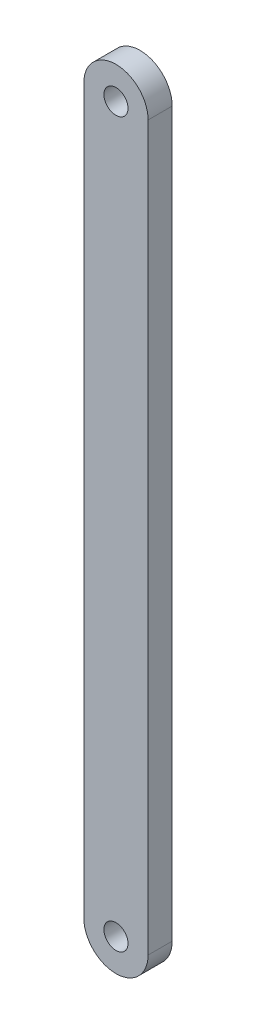
ISO-10303-21;
HEADER;
FILE_DESCRIPTION(('STEP AP214'),'2;1');
FILE_NAME('part.step','',(''),(''),'','','');
FILE_SCHEMA(('AUTOMOTIVE_DESIGN { 1 0 10303 214 1 1 1 1 }'));
ENDSEC;
DATA;
#1=APPLICATION_CONTEXT('core data for automotive mechanical design processes');
#2=APPLICATION_PROTOCOL_DEFINITION('international standard','automotive_design',2000,#1);
#3=PRODUCT_CONTEXT('',#1,'mechanical');
#4=PRODUCT('Part','Part','',(#3));
#5=PRODUCT_RELATED_PRODUCT_CATEGORY('part','',(#4));
#6=PRODUCT_DEFINITION_FORMATION('','',#4);
#7=PRODUCT_DEFINITION_CONTEXT('part definition',#1,'design');
#8=PRODUCT_DEFINITION('design','',#6,#7);
#9=PRODUCT_DEFINITION_SHAPE('','',#8);
#10=(LENGTH_UNIT() NAMED_UNIT(*) SI_UNIT(.MILLI.,.METRE.));
#11=(NAMED_UNIT(*) PLANE_ANGLE_UNIT() SI_UNIT($,.RADIAN.));
#12=(NAMED_UNIT(*) SI_UNIT($,.STERADIAN.) SOLID_ANGLE_UNIT());
#13=UNCERTAINTY_MEASURE_WITH_UNIT(LENGTH_MEASURE(1.E-05),#10,'distance_accuracy_value','');
#14=(GEOMETRIC_REPRESENTATION_CONTEXT(3) GLOBAL_UNCERTAINTY_ASSIGNED_CONTEXT((#13)) GLOBAL_UNIT_ASSIGNED_CONTEXT((#10,
#11,#12)) REPRESENTATION_CONTEXT('',''));
#15=CARTESIAN_POINT('',(0.,0.,0.));
#16=DIRECTION('',(0.,0.,1.));
#17=DIRECTION('',(1.,0.,0.));
#18=AXIS2_PLACEMENT_3D('',#15,#16,#17);
#19=CARTESIAN_POINT('',(3.99999999999999,45.,3.));
#20=DIRECTION('',(-1.,0.,0.));
#21=DIRECTION('',(0.,-1.,0.));
#22=AXIS2_PLACEMENT_3D('',#19,#20,#21);
#23=PLANE('',#22);
#24=DIRECTION('',(0.,1.,0.));
#25=VECTOR('',#24,1.);
#26=CARTESIAN_POINT('',(3.99999999999999,45.,0.));
#27=LINE('',#26,#25);
#28=CARTESIAN_POINT('',(4.,-45.,0.));
#29=VERTEX_POINT('',#28);
#30=CARTESIAN_POINT('',(4.,45.,0.));
#31=VERTEX_POINT('',#30);
#32=EDGE_CURVE('E76',#29,#31,#27,.T.);
#33=ORIENTED_EDGE('',*,*,#32,.T.);
#34=DIRECTION('',(0.,0.,-1.));
#35=VECTOR('',#34,1.);
#36=CARTESIAN_POINT('',(3.99999999999999,45.,3.));
#37=LINE('',#36,#35);
#38=CARTESIAN_POINT('',(4.,45.,3.));
#39=VERTEX_POINT('',#38);
#40=EDGE_CURVE('E11',#39,#31,#37,.T.);
#41=ORIENTED_EDGE('',*,*,#40,.F.);
#42=DIRECTION('',(0.,1.,0.));
#43=VECTOR('',#42,1.);
#44=CARTESIAN_POINT('',(3.99999999999999,45.,3.));
#45=LINE('',#44,#43);
#46=CARTESIAN_POINT('',(4.00000000000001,-45.,3.));
#47=VERTEX_POINT('',#46);
#48=EDGE_CURVE('E51',#47,#39,#45,.T.);
#49=ORIENTED_EDGE('',*,*,#48,.F.);
#50=DIRECTION('',(0.,0.,-1.));
#51=VECTOR('',#50,1.);
#52=CARTESIAN_POINT('',(4.00000000000001,-45.,3.));
#53=LINE('',#52,#51);
#54=EDGE_CURVE('E84',#47,#29,#53,.T.);
#55=ORIENTED_EDGE('',*,*,#54,.T.);
#56=EDGE_LOOP('',(#33,#41,#49,#55));
#57=FACE_BOUND('',#56,.T.);
#58=ADVANCED_FACE('F35',(#57),#23,.F.);
#59=CARTESIAN_POINT('',(-4.,45.,3.));
#60=DIRECTION('',(1.,0.,0.));
#61=DIRECTION('',(0.,1.,0.));
#62=AXIS2_PLACEMENT_3D('',#59,#60,#61);
#63=PLANE('',#62);
#64=DIRECTION('',(0.,-1.,0.));
#65=VECTOR('',#64,1.);
#66=CARTESIAN_POINT('',(-4.,45.,0.));
#67=LINE('',#66,#65);
#68=CARTESIAN_POINT('',(-4.,45.,0.));
#69=VERTEX_POINT('',#68);
#70=CARTESIAN_POINT('',(-3.99999999999999,-45.,0.));
#71=VERTEX_POINT('',#70);
#72=EDGE_CURVE('E81',#69,#71,#67,.T.);
#73=ORIENTED_EDGE('',*,*,#72,.T.);
#74=DIRECTION('',(0.,0.,-1.));
#75=VECTOR('',#74,1.);
#76=CARTESIAN_POINT('',(-3.99999999999999,-45.,3.));
#77=LINE('',#76,#75);
#78=CARTESIAN_POINT('',(-3.99999999999999,-45.,3.));
#79=VERTEX_POINT('',#78);
#80=EDGE_CURVE('E88',#79,#71,#77,.T.);
#81=ORIENTED_EDGE('',*,*,#80,.F.);
#82=DIRECTION('',(0.,-1.,0.));
#83=VECTOR('',#82,1.);
#84=CARTESIAN_POINT('',(-4.,45.,3.));
#85=LINE('',#84,#83);
#86=CARTESIAN_POINT('',(-4.,45.,3.));
#87=VERTEX_POINT('',#86);
#88=EDGE_CURVE('E89',#87,#79,#85,.T.);
#89=ORIENTED_EDGE('',*,*,#88,.F.);
#90=DIRECTION('',(0.,0.,-1.));
#91=VECTOR('',#90,1.);
#92=CARTESIAN_POINT('',(-4.,45.,3.));
#93=LINE('',#92,#91);
#94=EDGE_CURVE('E43',#87,#69,#93,.T.);
#95=ORIENTED_EDGE('',*,*,#94,.T.);
#96=EDGE_LOOP('',(#73,#81,#89,#95));
#97=FACE_BOUND('',#96,.T.);
#98=ADVANCED_FACE('F111',(#97),#63,.F.);
#99=CARTESIAN_POINT('',(0.,0.,3.));
#100=DIRECTION('',(0.,0.,1.));
#101=DIRECTION('',(1.,0.,0.));
#102=AXIS2_PLACEMENT_3D('',#99,#100,#101);
#103=PLANE('',#102);
#104=CARTESIAN_POINT('',(0.,45.,3.));
#105=DIRECTION('',(0.,0.,1.));
#106=DIRECTION('',(1.,0.,0.));
#107=AXIS2_PLACEMENT_3D('',#104,#105,#106);
#108=CIRCLE('',#107,1.5);
#109=CARTESIAN_POINT('',(1.5,45.,3.));
#110=VERTEX_POINT('',#109);
#111=EDGE_CURVE('E99',#110,#110,#108,.T.);
#112=ORIENTED_EDGE('',*,*,#111,.F.);
#113=EDGE_LOOP('',(#112));
#114=FACE_BOUND('',#113,.T.);
#115=CARTESIAN_POINT('',(0.,-45.,3.));
#116=DIRECTION('',(0.,0.,1.));
#117=DIRECTION('',(1.,0.,0.));
#118=AXIS2_PLACEMENT_3D('',#115,#116,#117);
#119=CIRCLE('',#118,1.5);
#120=CARTESIAN_POINT('',(1.5,-45.,3.));
#121=VERTEX_POINT('',#120);
#122=EDGE_CURVE('E192',#121,#121,#119,.T.);
#123=ORIENTED_EDGE('',*,*,#122,.F.);
#124=EDGE_LOOP('',(#123));
#125=FACE_BOUND('',#124,.T.);
#126=ORIENTED_EDGE('',*,*,#88,.T.);
#127=CARTESIAN_POINT('',(0.,-45.,3.));
#128=DIRECTION('',(0.,0.,1.));
#129=DIRECTION('',(1.,0.,0.));
#130=AXIS2_PLACEMENT_3D('',#127,#128,#129);
#131=CIRCLE('',#130,4.);
#132=EDGE_CURVE('E94',#79,#47,#131,.T.);
#133=ORIENTED_EDGE('',*,*,#132,.T.);
#134=ORIENTED_EDGE('',*,*,#48,.T.);
#135=CARTESIAN_POINT('',(0.,45.,3.));
#136=DIRECTION('',(0.,0.,1.));
#137=DIRECTION('',(1.,0.,0.));
#138=AXIS2_PLACEMENT_3D('',#135,#136,#137);
#139=CIRCLE('',#138,4.);
#140=EDGE_CURVE('E82',#39,#87,#139,.T.);
#141=ORIENTED_EDGE('',*,*,#140,.T.);
#142=EDGE_LOOP('',(#126,#133,#134,#141));
#143=FACE_BOUND('',#142,.T.);
#144=ADVANCED_FACE('F114',(#114,#125,#143),#103,.T.);
#145=CARTESIAN_POINT('',(0.,0.,0.));
#146=DIRECTION('',(0.,0.,1.));
#147=DIRECTION('',(1.,0.,0.));
#148=AXIS2_PLACEMENT_3D('',#145,#146,#147);
#149=PLANE('',#148);
#150=CARTESIAN_POINT('',(0.,45.,0.));
#151=DIRECTION('',(0.,0.,1.));
#152=DIRECTION('',(1.,0.,0.));
#153=AXIS2_PLACEMENT_3D('',#150,#151,#152);
#154=CIRCLE('',#153,1.5);
#155=CARTESIAN_POINT('',(1.5,45.,0.));
#156=VERTEX_POINT('',#155);
#157=EDGE_CURVE('E95',#156,#156,#154,.T.);
#158=ORIENTED_EDGE('',*,*,#157,.T.);
#159=EDGE_LOOP('',(#158));
#160=FACE_BOUND('',#159,.T.);
#161=CARTESIAN_POINT('',(0.,-45.,0.));
#162=DIRECTION('',(0.,0.,1.));
#163=DIRECTION('',(1.,0.,0.));
#164=AXIS2_PLACEMENT_3D('',#161,#162,#163);
#165=CIRCLE('',#164,1.5);
#166=CARTESIAN_POINT('',(1.5,-45.,0.));
#167=VERTEX_POINT('',#166);
#168=EDGE_CURVE('E189',#167,#167,#165,.T.);
#169=ORIENTED_EDGE('',*,*,#168,.T.);
#170=EDGE_LOOP('',(#169));
#171=FACE_BOUND('',#170,.T.);
#172=ORIENTED_EDGE('',*,*,#32,.F.);
#173=CARTESIAN_POINT('',(0.,-45.,0.));
#174=DIRECTION('',(0.,0.,1.));
#175=DIRECTION('',(1.,0.,0.));
#176=AXIS2_PLACEMENT_3D('',#173,#174,#175);
#177=CIRCLE('',#176,4.);
#178=EDGE_CURVE('E80',#71,#29,#177,.T.);
#179=ORIENTED_EDGE('',*,*,#178,.F.);
#180=ORIENTED_EDGE('',*,*,#72,.F.);
#181=CARTESIAN_POINT('',(0.,45.,0.));
#182=DIRECTION('',(0.,0.,1.));
#183=DIRECTION('',(1.,0.,0.));
#184=AXIS2_PLACEMENT_3D('',#181,#182,#183);
#185=CIRCLE('',#184,4.);
#186=EDGE_CURVE('E62',#31,#69,#185,.T.);
#187=ORIENTED_EDGE('',*,*,#186,.F.);
#188=EDGE_LOOP('',(#172,#179,#180,#187));
#189=FACE_BOUND('',#188,.T.);
#190=ADVANCED_FACE('F77',(#160,#171,#189),#149,.F.);
#191=CARTESIAN_POINT('',(0.,45.,3.));
#192=DIRECTION('',(0.,0.,-1.));
#193=DIRECTION('',(-1.,0.,0.));
#194=AXIS2_PLACEMENT_3D('',#191,#192,#193);
#195=CYLINDRICAL_SURFACE('',#194,4.);
#196=ORIENTED_EDGE('',*,*,#140,.F.);
#197=ORIENTED_EDGE('',*,*,#40,.T.);
#198=ORIENTED_EDGE('',*,*,#186,.T.);
#199=ORIENTED_EDGE('',*,*,#94,.F.);
#200=EDGE_LOOP('',(#196,#197,#198,#199));
#201=FACE_BOUND('',#200,.T.);
#202=ADVANCED_FACE('F112',(#201),#195,.T.);
#203=CARTESIAN_POINT('',(0.,-45.,3.));
#204=DIRECTION('',(0.,0.,-1.));
#205=DIRECTION('',(-1.,0.,0.));
#206=AXIS2_PLACEMENT_3D('',#203,#204,#205);
#207=CYLINDRICAL_SURFACE('',#206,4.);
#208=ORIENTED_EDGE('',*,*,#178,.T.);
#209=ORIENTED_EDGE('',*,*,#54,.F.);
#210=ORIENTED_EDGE('',*,*,#132,.F.);
#211=ORIENTED_EDGE('',*,*,#80,.T.);
#212=EDGE_LOOP('',(#208,#209,#210,#211));
#213=FACE_BOUND('',#212,.T.);
#214=ADVANCED_FACE('F92',(#213),#207,.T.);
#215=CARTESIAN_POINT('',(0.,-45.,0.));
#216=DIRECTION('',(0.,0.,1.));
#217=DIRECTION('',(1.,0.,0.));
#218=AXIS2_PLACEMENT_3D('',#215,#216,#217);
#219=CYLINDRICAL_SURFACE('',#218,1.5);
#220=ORIENTED_EDGE('',*,*,#168,.F.);
#221=EDGE_LOOP('',(#220));
#222=FACE_BOUND('',#221,.T.);
#223=ORIENTED_EDGE('',*,*,#122,.T.);
#224=EDGE_LOOP('',(#223));
#225=FACE_BOUND('',#224,.T.);
#226=ADVANCED_FACE('F151',(#222,#225),#219,.F.);
#227=CARTESIAN_POINT('',(0.,45.,0.));
#228=DIRECTION('',(0.,0.,1.));
#229=DIRECTION('',(1.,0.,0.));
#230=AXIS2_PLACEMENT_3D('',#227,#228,#229);
#231=CYLINDRICAL_SURFACE('',#230,1.5);
#232=ORIENTED_EDGE('',*,*,#157,.F.);
#233=EDGE_LOOP('',(#232));
#234=FACE_BOUND('',#233,.T.);
#235=ORIENTED_EDGE('',*,*,#111,.T.);
#236=EDGE_LOOP('',(#235));
#237=FACE_BOUND('',#236,.T.);
#238=ADVANCED_FACE('F172',(#234,#237),#231,.F.);
#239=CLOSED_SHELL('',(#58,#98,#144,#190,#202,#214,#226,#238));
#240=MANIFOLD_SOLID_BREP('B2',#239);
#241=ADVANCED_BREP_SHAPE_REPRESENTATION('',(#18,#240),#14);
#242=SHAPE_DEFINITION_REPRESENTATION(#9,#241);
ENDSEC;
END-ISO-10303-21;
